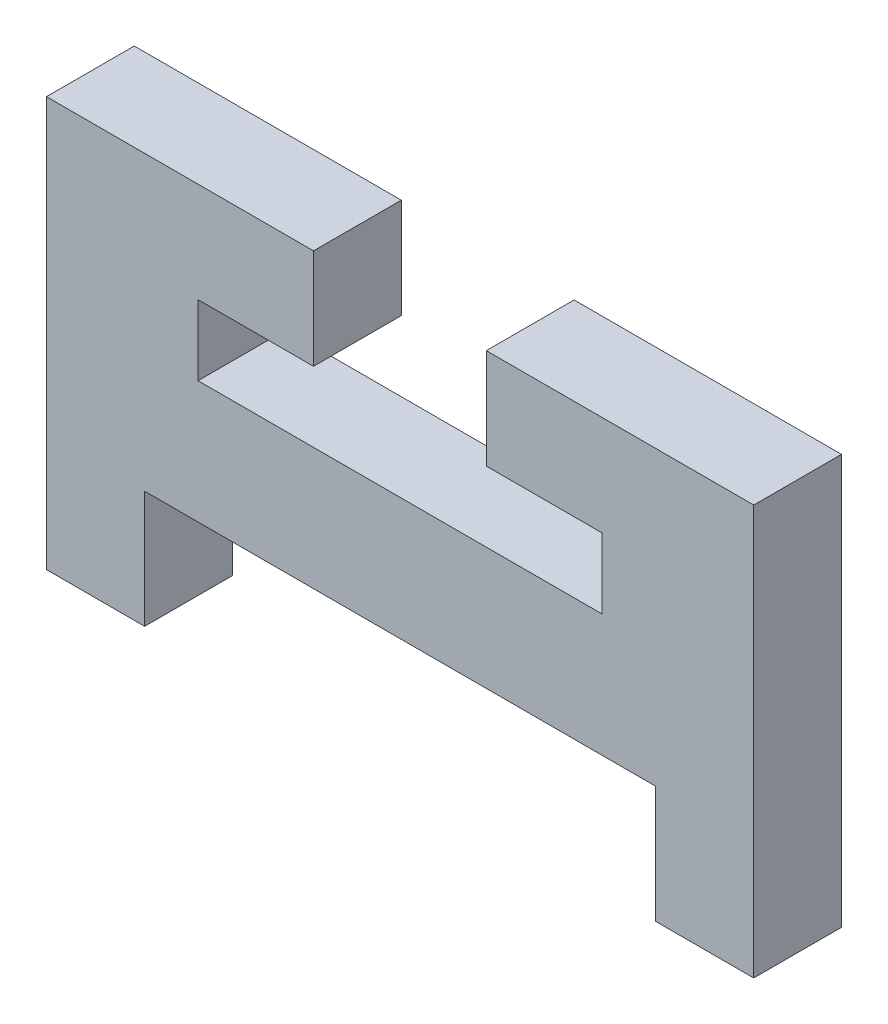
ISO-10303-21;
HEADER;
FILE_DESCRIPTION(('STEP AP214'),'2;1');
FILE_NAME('part.step','',(''),(''),'','','');
FILE_SCHEMA(('AUTOMOTIVE_DESIGN { 1 0 10303 214 1 1 1 1 }'));
ENDSEC;
DATA;
#1=APPLICATION_CONTEXT('core data for automotive mechanical design processes');
#2=APPLICATION_PROTOCOL_DEFINITION('international standard','automotive_design',2000,#1);
#3=PRODUCT_CONTEXT('',#1,'mechanical');
#4=PRODUCT('Part','Part','',(#3));
#5=PRODUCT_RELATED_PRODUCT_CATEGORY('part','',(#4));
#6=PRODUCT_DEFINITION_FORMATION('','',#4);
#7=PRODUCT_DEFINITION_CONTEXT('part definition',#1,'design');
#8=PRODUCT_DEFINITION('design','',#6,#7);
#9=PRODUCT_DEFINITION_SHAPE('','',#8);
#10=(LENGTH_UNIT() NAMED_UNIT(*) SI_UNIT(.MILLI.,.METRE.));
#11=(NAMED_UNIT(*) PLANE_ANGLE_UNIT() SI_UNIT($,.RADIAN.));
#12=(NAMED_UNIT(*) SI_UNIT($,.STERADIAN.) SOLID_ANGLE_UNIT());
#13=UNCERTAINTY_MEASURE_WITH_UNIT(LENGTH_MEASURE(1.E-05),#10,'distance_accuracy_value','');
#14=(GEOMETRIC_REPRESENTATION_CONTEXT(3) GLOBAL_UNCERTAINTY_ASSIGNED_CONTEXT((#13)) GLOBAL_UNIT_ASSIGNED_CONTEXT((#10,
#11,#12)) REPRESENTATION_CONTEXT('',''));
#15=CARTESIAN_POINT('',(0.,0.,0.));
#16=DIRECTION('',(0.,0.,1.));
#17=DIRECTION('',(1.,0.,0.));
#18=AXIS2_PLACEMENT_3D('',#15,#16,#17);
#19=CARTESIAN_POINT('',(31.7,16.7826832944775,3.));
#20=DIRECTION('',(0.,-1.,0.));
#21=DIRECTION('',(0.,0.,-1.));
#22=AXIS2_PLACEMENT_3D('',#19,#20,#21);
#23=PLANE('',#22);
#24=DIRECTION('',(-1.,0.,0.));
#25=VECTOR('',#24,1.);
#26=CARTESIAN_POINT('',(31.7,16.7826832944775,0.));
#27=LINE('',#26,#25);
#28=CARTESIAN_POINT('',(38.1066666666667,16.7826832944775,0.));
#29=VERTEX_POINT('',#28);
#30=CARTESIAN_POINT('',(24.2933333333334,16.7826832944775,0.));
#31=VERTEX_POINT('',#30);
#32=EDGE_CURVE('E110',#29,#31,#27,.T.);
#33=ORIENTED_EDGE('',*,*,#32,.T.);
#34=DIRECTION('',(0.,0.,-1.));
#35=VECTOR('',#34,1.);
#36=CARTESIAN_POINT('',(24.2933333333334,16.7826832944775,3.));
#37=LINE('',#36,#35);
#38=CARTESIAN_POINT('',(24.2933333333334,16.7826832944775,3.));
#39=VERTEX_POINT('',#38);
#40=EDGE_CURVE('E11',#39,#31,#37,.T.);
#41=ORIENTED_EDGE('',*,*,#40,.F.);
#42=DIRECTION('',(-1.,0.,0.));
#43=VECTOR('',#42,1.);
#44=CARTESIAN_POINT('',(38.1066666666667,16.7826832944775,3.));
#45=LINE('',#44,#43);
#46=CARTESIAN_POINT('',(38.1066666666667,16.7826832944775,3.));
#47=VERTEX_POINT('',#46);
#48=EDGE_CURVE('E116',#47,#39,#45,.T.);
#49=ORIENTED_EDGE('',*,*,#48,.F.);
#50=DIRECTION('',(0.,0.,-1.));
#51=VECTOR('',#50,1.);
#52=CARTESIAN_POINT('',(38.1066666666667,16.7826832944775,3.));
#53=LINE('',#52,#51);
#54=EDGE_CURVE('E174',#47,#29,#53,.T.);
#55=ORIENTED_EDGE('',*,*,#54,.T.);
#56=EDGE_LOOP('',(#33,#41,#49,#55));
#57=FACE_BOUND('',#56,.T.);
#58=ADVANCED_FACE('F34',(#57),#23,.F.);
#59=CARTESIAN_POINT('',(24.2933333333334,16.7826832944775,3.));
#60=DIRECTION('',(-1.,0.,0.));
#61=DIRECTION('',(0.,0.,1.));
#62=AXIS2_PLACEMENT_3D('',#59,#60,#61);
#63=PLANE('',#62);
#64=DIRECTION('',(0.,1.,0.));
#65=VECTOR('',#64,1.);
#66=CARTESIAN_POINT('',(24.2933333333334,16.7826832944775,0.));
#67=LINE('',#66,#65);
#68=CARTESIAN_POINT('',(24.2933333333334,19.1826832944775,0.));
#69=VERTEX_POINT('',#68);
#70=EDGE_CURVE('E179',#31,#69,#67,.T.);
#71=ORIENTED_EDGE('',*,*,#70,.T.);
#72=DIRECTION('',(0.,0.,-1.));
#73=VECTOR('',#72,1.);
#74=CARTESIAN_POINT('',(24.2933333333334,19.1826832944775,3.));
#75=LINE('',#74,#73);
#76=CARTESIAN_POINT('',(24.2933333333334,19.1826832944775,3.));
#77=VERTEX_POINT('',#76);
#78=EDGE_CURVE('E42',#77,#69,#75,.T.);
#79=ORIENTED_EDGE('',*,*,#78,.F.);
#80=DIRECTION('',(0.,1.,0.));
#81=VECTOR('',#80,1.);
#82=CARTESIAN_POINT('',(24.2933333333334,16.7826832944775,3.));
#83=LINE('',#82,#81);
#84=EDGE_CURVE('E295',#39,#77,#83,.T.);
#85=ORIENTED_EDGE('',*,*,#84,.F.);
#86=ORIENTED_EDGE('',*,*,#40,.T.);
#87=EDGE_LOOP('',(#71,#79,#85,#86));
#88=FACE_BOUND('',#87,.T.);
#89=ADVANCED_FACE('F298',(#88),#63,.F.);
#90=CARTESIAN_POINT('',(24.2933333333334,19.1826832944775,3.));
#91=DIRECTION('',(0.,1.,0.));
#92=DIRECTION('',(0.,0.,1.));
#93=AXIS2_PLACEMENT_3D('',#90,#91,#92);
#94=PLANE('',#93);
#95=DIRECTION('',(1.,0.,0.));
#96=VECTOR('',#95,1.);
#97=CARTESIAN_POINT('',(24.2933333333334,19.1826832944775,0.));
#98=LINE('',#97,#96);
#99=CARTESIAN_POINT('',(28.24,19.1826832944775,0.));
#100=VERTEX_POINT('',#99);
#101=EDGE_CURVE('E181',#69,#100,#98,.T.);
#102=ORIENTED_EDGE('',*,*,#101,.T.);
#103=DIRECTION('',(0.,0.,-1.));
#104=VECTOR('',#103,1.);
#105=CARTESIAN_POINT('',(28.24,19.1826832944775,3.));
#106=LINE('',#105,#104);
#107=CARTESIAN_POINT('',(28.24,19.1826832944775,3.));
#108=VERTEX_POINT('',#107);
#109=EDGE_CURVE('E238',#108,#100,#106,.T.);
#110=ORIENTED_EDGE('',*,*,#109,.F.);
#111=DIRECTION('',(1.,0.,0.));
#112=VECTOR('',#111,1.);
#113=CARTESIAN_POINT('',(24.2933333333334,19.1826832944775,3.));
#114=LINE('',#113,#112);
#115=EDGE_CURVE('E247',#77,#108,#114,.T.);
#116=ORIENTED_EDGE('',*,*,#115,.F.);
#117=ORIENTED_EDGE('',*,*,#78,.T.);
#118=EDGE_LOOP('',(#102,#110,#116,#117));
#119=FACE_BOUND('',#118,.T.);
#120=ADVANCED_FACE('F245',(#119),#94,.F.);
#121=CARTESIAN_POINT('',(28.24,19.1826832944775,3.));
#122=DIRECTION('',(-1.,0.,0.));
#123=DIRECTION('',(0.,0.,1.));
#124=AXIS2_PLACEMENT_3D('',#121,#122,#123);
#125=PLANE('',#124);
#126=DIRECTION('',(0.,1.,0.));
#127=VECTOR('',#126,1.);
#128=CARTESIAN_POINT('',(28.24,19.1826832944775,0.));
#129=LINE('',#128,#127);
#130=CARTESIAN_POINT('',(28.24,22.6,0.));
#131=VERTEX_POINT('',#130);
#132=EDGE_CURVE('E183',#100,#131,#129,.T.);
#133=ORIENTED_EDGE('',*,*,#132,.T.);
#134=DIRECTION('',(0.,0.,-1.));
#135=VECTOR('',#134,1.);
#136=CARTESIAN_POINT('',(28.24,22.6,3.));
#137=LINE('',#136,#135);
#138=CARTESIAN_POINT('',(28.24,22.6,3.));
#139=VERTEX_POINT('',#138);
#140=EDGE_CURVE('E235',#139,#131,#137,.T.);
#141=ORIENTED_EDGE('',*,*,#140,.F.);
#142=DIRECTION('',(0.,1.,0.));
#143=VECTOR('',#142,1.);
#144=CARTESIAN_POINT('',(28.24,19.1826832944775,3.));
#145=LINE('',#144,#143);
#146=EDGE_CURVE('E265',#108,#139,#145,.T.);
#147=ORIENTED_EDGE('',*,*,#146,.F.);
#148=ORIENTED_EDGE('',*,*,#109,.T.);
#149=EDGE_LOOP('',(#133,#141,#147,#148));
#150=FACE_BOUND('',#149,.T.);
#151=ADVANCED_FACE('F256',(#150),#125,.F.);
#152=CARTESIAN_POINT('',(28.24,22.6,3.));
#153=DIRECTION('',(0.,-1.,0.));
#154=DIRECTION('',(0.,0.,-1.));
#155=AXIS2_PLACEMENT_3D('',#152,#153,#154);
#156=PLANE('',#155);
#157=DIRECTION('',(-1.,0.,0.));
#158=VECTOR('',#157,1.);
#159=CARTESIAN_POINT('',(28.24,22.6,0.));
#160=LINE('',#159,#158);
#161=CARTESIAN_POINT('',(19.1133333333333,22.6,0.));
#162=VERTEX_POINT('',#161);
#163=EDGE_CURVE('E185',#131,#162,#160,.T.);
#164=ORIENTED_EDGE('',*,*,#163,.T.);
#165=DIRECTION('',(0.,0.,-1.));
#166=VECTOR('',#165,1.);
#167=CARTESIAN_POINT('',(19.1133333333333,22.6,3.));
#168=LINE('',#167,#166);
#169=CARTESIAN_POINT('',(19.1133333333333,22.6,3.));
#170=VERTEX_POINT('',#169);
#171=EDGE_CURVE('E232',#170,#162,#168,.T.);
#172=ORIENTED_EDGE('',*,*,#171,.F.);
#173=DIRECTION('',(-1.,0.,0.));
#174=VECTOR('',#173,1.);
#175=CARTESIAN_POINT('',(28.24,22.6,3.));
#176=LINE('',#175,#174);
#177=EDGE_CURVE('E262',#139,#170,#176,.T.);
#178=ORIENTED_EDGE('',*,*,#177,.F.);
#179=ORIENTED_EDGE('',*,*,#140,.T.);
#180=EDGE_LOOP('',(#164,#172,#178,#179));
#181=FACE_BOUND('',#180,.T.);
#182=ADVANCED_FACE('F260',(#181),#156,.F.);
#183=CARTESIAN_POINT('',(19.1133333333333,22.6,3.));
#184=DIRECTION('',(1.,0.,0.));
#185=DIRECTION('',(0.,0.,-1.));
#186=AXIS2_PLACEMENT_3D('',#183,#184,#185);
#187=PLANE('',#186);
#188=DIRECTION('',(0.,-1.,0.));
#189=VECTOR('',#188,1.);
#190=CARTESIAN_POINT('',(19.1133333333333,22.6,0.));
#191=LINE('',#190,#189);
#192=CARTESIAN_POINT('',(19.1133333333333,8.59999999999999,0.));
#193=VERTEX_POINT('',#192);
#194=EDGE_CURVE('E187',#162,#193,#191,.T.);
#195=ORIENTED_EDGE('',*,*,#194,.T.);
#196=DIRECTION('',(0.,0.,-1.));
#197=VECTOR('',#196,1.);
#198=CARTESIAN_POINT('',(19.1133333333333,8.59999999999999,3.));
#199=LINE('',#198,#197);
#200=CARTESIAN_POINT('',(19.1133333333333,8.59999999999999,3.));
#201=VERTEX_POINT('',#200);
#202=EDGE_CURVE('E229',#201,#193,#199,.T.);
#203=ORIENTED_EDGE('',*,*,#202,.F.);
#204=DIRECTION('',(0.,-1.,0.));
#205=VECTOR('',#204,1.);
#206=CARTESIAN_POINT('',(19.1133333333333,22.6,3.));
#207=LINE('',#206,#205);
#208=EDGE_CURVE('E264',#170,#201,#207,.T.);
#209=ORIENTED_EDGE('',*,*,#208,.F.);
#210=ORIENTED_EDGE('',*,*,#171,.T.);
#211=EDGE_LOOP('',(#195,#203,#209,#210));
#212=FACE_BOUND('',#211,.T.);
#213=ADVANCED_FACE('F310',(#212),#187,.F.);
#214=CARTESIAN_POINT('',(19.1133333333333,8.59999999999999,3.));
#215=DIRECTION('',(0.,1.,0.));
#216=DIRECTION('',(0.,0.,1.));
#217=AXIS2_PLACEMENT_3D('',#214,#215,#216);
#218=PLANE('',#217);
#219=DIRECTION('',(1.,0.,0.));
#220=VECTOR('',#219,1.);
#221=CARTESIAN_POINT('',(19.1133333333333,8.59999999999999,0.));
#222=LINE('',#221,#220);
#223=CARTESIAN_POINT('',(22.468,8.59999999999999,0.));
#224=VERTEX_POINT('',#223);
#225=EDGE_CURVE('E189',#193,#224,#222,.T.);
#226=ORIENTED_EDGE('',*,*,#225,.T.);
#227=DIRECTION('',(0.,0.,-1.));
#228=VECTOR('',#227,1.);
#229=CARTESIAN_POINT('',(22.468,8.59999999999999,3.));
#230=LINE('',#229,#228);
#231=CARTESIAN_POINT('',(22.468,8.59999999999999,3.));
#232=VERTEX_POINT('',#231);
#233=EDGE_CURVE('E226',#232,#224,#230,.T.);
#234=ORIENTED_EDGE('',*,*,#233,.F.);
#235=DIRECTION('',(1.,0.,0.));
#236=VECTOR('',#235,1.);
#237=CARTESIAN_POINT('',(19.1133333333333,8.59999999999999,3.));
#238=LINE('',#237,#236);
#239=EDGE_CURVE('E267',#201,#232,#238,.T.);
#240=ORIENTED_EDGE('',*,*,#239,.F.);
#241=ORIENTED_EDGE('',*,*,#202,.T.);
#242=EDGE_LOOP('',(#226,#234,#240,#241));
#243=FACE_BOUND('',#242,.T.);
#244=ADVANCED_FACE('F313',(#243),#218,.F.);
#245=CARTESIAN_POINT('',(22.468,8.59999999999999,3.));
#246=DIRECTION('',(-1.,0.,0.));
#247=DIRECTION('',(0.,0.,1.));
#248=AXIS2_PLACEMENT_3D('',#245,#246,#247);
#249=PLANE('',#248);
#250=DIRECTION('',(0.,1.,0.));
#251=VECTOR('',#250,1.);
#252=CARTESIAN_POINT('',(22.468,8.59999999999999,0.));
#253=LINE('',#252,#251);
#254=CARTESIAN_POINT('',(22.468,12.6,0.));
#255=VERTEX_POINT('',#254);
#256=EDGE_CURVE('E191',#224,#255,#253,.T.);
#257=ORIENTED_EDGE('',*,*,#256,.T.);
#258=DIRECTION('',(0.,0.,-1.));
#259=VECTOR('',#258,1.);
#260=CARTESIAN_POINT('',(22.468,12.6,3.));
#261=LINE('',#260,#259);
#262=CARTESIAN_POINT('',(22.468,12.6,3.));
#263=VERTEX_POINT('',#262);
#264=EDGE_CURVE('E223',#263,#255,#261,.T.);
#265=ORIENTED_EDGE('',*,*,#264,.F.);
#266=DIRECTION('',(0.,1.,0.));
#267=VECTOR('',#266,1.);
#268=CARTESIAN_POINT('',(22.468,8.59999999999999,3.));
#269=LINE('',#268,#267);
#270=EDGE_CURVE('E273',#232,#263,#269,.T.);
#271=ORIENTED_EDGE('',*,*,#270,.F.);
#272=ORIENTED_EDGE('',*,*,#233,.T.);
#273=EDGE_LOOP('',(#257,#265,#271,#272));
#274=FACE_BOUND('',#273,.T.);
#275=ADVANCED_FACE('F317',(#274),#249,.F.);
#276=CARTESIAN_POINT('',(22.468,12.6,3.));
#277=DIRECTION('',(0.,1.,0.));
#278=DIRECTION('',(0.,0.,1.));
#279=AXIS2_PLACEMENT_3D('',#276,#277,#278);
#280=PLANE('',#279);
#281=DIRECTION('',(1.,0.,0.));
#282=VECTOR('',#281,1.);
#283=CARTESIAN_POINT('',(22.468,12.6,0.));
#284=LINE('',#283,#282);
#285=CARTESIAN_POINT('',(39.932,12.6,0.));
#286=VERTEX_POINT('',#285);
#287=EDGE_CURVE('E193',#255,#286,#284,.T.);
#288=ORIENTED_EDGE('',*,*,#287,.T.);
#289=DIRECTION('',(0.,0.,-1.));
#290=VECTOR('',#289,1.);
#291=CARTESIAN_POINT('',(39.932,12.6,3.));
#292=LINE('',#291,#290);
#293=CARTESIAN_POINT('',(39.932,12.6,3.));
#294=VERTEX_POINT('',#293);
#295=EDGE_CURVE('E220',#294,#286,#292,.T.);
#296=ORIENTED_EDGE('',*,*,#295,.F.);
#297=DIRECTION('',(1.,0.,0.));
#298=VECTOR('',#297,1.);
#299=CARTESIAN_POINT('',(22.468,12.6,3.));
#300=LINE('',#299,#298);
#301=EDGE_CURVE('E275',#263,#294,#300,.T.);
#302=ORIENTED_EDGE('',*,*,#301,.F.);
#303=ORIENTED_EDGE('',*,*,#264,.T.);
#304=EDGE_LOOP('',(#288,#296,#302,#303));
#305=FACE_BOUND('',#304,.T.);
#306=ADVANCED_FACE('F321',(#305),#280,.F.);
#307=CARTESIAN_POINT('',(39.932,12.6,3.));
#308=DIRECTION('',(1.,0.,0.));
#309=DIRECTION('',(0.,0.,-1.));
#310=AXIS2_PLACEMENT_3D('',#307,#308,#309);
#311=PLANE('',#310);
#312=DIRECTION('',(0.,-1.,0.));
#313=VECTOR('',#312,1.);
#314=CARTESIAN_POINT('',(39.932,12.6,0.));
#315=LINE('',#314,#313);
#316=CARTESIAN_POINT('',(39.932,8.59999999999999,0.));
#317=VERTEX_POINT('',#316);
#318=EDGE_CURVE('E195',#286,#317,#315,.T.);
#319=ORIENTED_EDGE('',*,*,#318,.T.);
#320=DIRECTION('',(0.,0.,-1.));
#321=VECTOR('',#320,1.);
#322=CARTESIAN_POINT('',(39.932,8.59999999999999,3.));
#323=LINE('',#322,#321);
#324=CARTESIAN_POINT('',(39.932,8.59999999999999,3.));
#325=VERTEX_POINT('',#324);
#326=EDGE_CURVE('E217',#325,#317,#323,.T.);
#327=ORIENTED_EDGE('',*,*,#326,.F.);
#328=DIRECTION('',(0.,-1.,0.));
#329=VECTOR('',#328,1.);
#330=CARTESIAN_POINT('',(39.932,12.6,3.));
#331=LINE('',#330,#329);
#332=EDGE_CURVE('E277',#294,#325,#331,.T.);
#333=ORIENTED_EDGE('',*,*,#332,.F.);
#334=ORIENTED_EDGE('',*,*,#295,.T.);
#335=EDGE_LOOP('',(#319,#327,#333,#334));
#336=FACE_BOUND('',#335,.T.);
#337=ADVANCED_FACE('F325',(#336),#311,.F.);
#338=CARTESIAN_POINT('',(39.932,8.59999999999999,3.));
#339=DIRECTION('',(0.,1.,0.));
#340=DIRECTION('',(0.,0.,1.));
#341=AXIS2_PLACEMENT_3D('',#338,#339,#340);
#342=PLANE('',#341);
#343=DIRECTION('',(1.,0.,0.));
#344=VECTOR('',#343,1.);
#345=CARTESIAN_POINT('',(39.932,8.59999999999999,0.));
#346=LINE('',#345,#344);
#347=CARTESIAN_POINT('',(43.2866666666667,8.59999999999999,0.));
#348=VERTEX_POINT('',#347);
#349=EDGE_CURVE('E197',#317,#348,#346,.T.);
#350=ORIENTED_EDGE('',*,*,#349,.T.);
#351=DIRECTION('',(0.,0.,-1.));
#352=VECTOR('',#351,1.);
#353=CARTESIAN_POINT('',(43.2866666666667,8.59999999999999,3.));
#354=LINE('',#353,#352);
#355=CARTESIAN_POINT('',(43.2866666666667,8.59999999999999,3.));
#356=VERTEX_POINT('',#355);
#357=EDGE_CURVE('E214',#356,#348,#354,.T.);
#358=ORIENTED_EDGE('',*,*,#357,.F.);
#359=DIRECTION('',(1.,0.,0.));
#360=VECTOR('',#359,1.);
#361=CARTESIAN_POINT('',(39.932,8.59999999999999,3.));
#362=LINE('',#361,#360);
#363=EDGE_CURVE('E279',#325,#356,#362,.T.);
#364=ORIENTED_EDGE('',*,*,#363,.F.);
#365=ORIENTED_EDGE('',*,*,#326,.T.);
#366=EDGE_LOOP('',(#350,#358,#364,#365));
#367=FACE_BOUND('',#366,.T.);
#368=ADVANCED_FACE('F329',(#367),#342,.F.);
#369=CARTESIAN_POINT('',(43.2866666666667,8.59999999999999,3.));
#370=DIRECTION('',(-1.,0.,0.));
#371=DIRECTION('',(0.,0.,1.));
#372=AXIS2_PLACEMENT_3D('',#369,#370,#371);
#373=PLANE('',#372);
#374=DIRECTION('',(0.,1.,0.));
#375=VECTOR('',#374,1.);
#376=CARTESIAN_POINT('',(43.2866666666667,8.59999999999999,0.));
#377=LINE('',#376,#375);
#378=CARTESIAN_POINT('',(43.2866666666667,22.6,0.));
#379=VERTEX_POINT('',#378);
#380=EDGE_CURVE('E199',#348,#379,#377,.T.);
#381=ORIENTED_EDGE('',*,*,#380,.T.);
#382=DIRECTION('',(0.,0.,-1.));
#383=VECTOR('',#382,1.);
#384=CARTESIAN_POINT('',(43.2866666666667,22.6,3.));
#385=LINE('',#384,#383);
#386=CARTESIAN_POINT('',(43.2866666666667,22.6,3.));
#387=VERTEX_POINT('',#386);
#388=EDGE_CURVE('E211',#387,#379,#385,.T.);
#389=ORIENTED_EDGE('',*,*,#388,.F.);
#390=DIRECTION('',(0.,1.,0.));
#391=VECTOR('',#390,1.);
#392=CARTESIAN_POINT('',(43.2866666666667,8.59999999999999,3.));
#393=LINE('',#392,#391);
#394=EDGE_CURVE('E281',#356,#387,#393,.T.);
#395=ORIENTED_EDGE('',*,*,#394,.F.);
#396=ORIENTED_EDGE('',*,*,#357,.T.);
#397=EDGE_LOOP('',(#381,#389,#395,#396));
#398=FACE_BOUND('',#397,.T.);
#399=ADVANCED_FACE('F287',(#398),#373,.F.);
#400=CARTESIAN_POINT('',(43.2866666666667,22.6,3.));
#401=DIRECTION('',(0.,-1.,0.));
#402=DIRECTION('',(0.,0.,-1.));
#403=AXIS2_PLACEMENT_3D('',#400,#401,#402);
#404=PLANE('',#403);
#405=DIRECTION('',(-1.,0.,0.));
#406=VECTOR('',#405,1.);
#407=CARTESIAN_POINT('',(43.2866666666667,22.6,0.));
#408=LINE('',#407,#406);
#409=CARTESIAN_POINT('',(34.1465669299953,22.6,0.));
#410=VERTEX_POINT('',#409);
#411=EDGE_CURVE('E201',#379,#410,#408,.T.);
#412=ORIENTED_EDGE('',*,*,#411,.T.);
#413=DIRECTION('',(0.,0.,-1.));
#414=VECTOR('',#413,1.);
#415=CARTESIAN_POINT('',(34.1465669299953,22.6,3.));
#416=LINE('',#415,#414);
#417=CARTESIAN_POINT('',(34.1465669299953,22.6,3.));
#418=VERTEX_POINT('',#417);
#419=EDGE_CURVE('E169',#418,#410,#416,.T.);
#420=ORIENTED_EDGE('',*,*,#419,.F.);
#421=DIRECTION('',(-1.,0.,0.));
#422=VECTOR('',#421,1.);
#423=CARTESIAN_POINT('',(43.2866666666667,22.6,3.));
#424=LINE('',#423,#422);
#425=EDGE_CURVE('E160',#387,#418,#424,.T.);
#426=ORIENTED_EDGE('',*,*,#425,.F.);
#427=ORIENTED_EDGE('',*,*,#388,.T.);
#428=EDGE_LOOP('',(#412,#420,#426,#427));
#429=FACE_BOUND('',#428,.T.);
#430=ADVANCED_FACE('F291',(#429),#404,.F.);
#431=CARTESIAN_POINT('',(34.1465669299953,22.6,3.));
#432=DIRECTION('',(1.,0.,0.));
#433=DIRECTION('',(0.,0.,-1.));
#434=AXIS2_PLACEMENT_3D('',#431,#432,#433);
#435=PLANE('',#434);
#436=DIRECTION('',(0.,-1.,0.));
#437=VECTOR('',#436,1.);
#438=CARTESIAN_POINT('',(34.1465669299953,22.6,0.));
#439=LINE('',#438,#437);
#440=CARTESIAN_POINT('',(34.1465669299953,19.1826832944775,0.));
#441=VERTEX_POINT('',#440);
#442=EDGE_CURVE('E168',#410,#441,#439,.T.);
#443=ORIENTED_EDGE('',*,*,#442,.T.);
#444=DIRECTION('',(0.,0.,-1.));
#445=VECTOR('',#444,1.);
#446=CARTESIAN_POINT('',(34.1465669299953,19.1826832944775,3.));
#447=LINE('',#446,#445);
#448=CARTESIAN_POINT('',(34.1465669299953,19.1826832944775,3.));
#449=VERTEX_POINT('',#448);
#450=EDGE_CURVE('E165',#449,#441,#447,.T.);
#451=ORIENTED_EDGE('',*,*,#450,.F.);
#452=DIRECTION('',(0.,-1.,0.));
#453=VECTOR('',#452,1.);
#454=CARTESIAN_POINT('',(34.1465669299953,22.6,3.));
#455=LINE('',#454,#453);
#456=EDGE_CURVE('E154',#418,#449,#455,.T.);
#457=ORIENTED_EDGE('',*,*,#456,.F.);
#458=ORIENTED_EDGE('',*,*,#419,.T.);
#459=EDGE_LOOP('',(#443,#451,#457,#458));
#460=FACE_BOUND('',#459,.T.);
#461=ADVANCED_FACE('F166',(#460),#435,.F.);
#462=CARTESIAN_POINT('',(34.1465669299953,19.1826832944775,3.));
#463=DIRECTION('',(0.,1.,0.));
#464=DIRECTION('',(0.,0.,1.));
#465=AXIS2_PLACEMENT_3D('',#462,#463,#464);
#466=PLANE('',#465);
#467=DIRECTION('',(1.,0.,0.));
#468=VECTOR('',#467,1.);
#469=CARTESIAN_POINT('',(34.1465669299953,19.1826832944775,0.));
#470=LINE('',#469,#468);
#471=CARTESIAN_POINT('',(38.1066666666667,19.1826832944775,0.));
#472=VERTEX_POINT('',#471);
#473=EDGE_CURVE('E103',#441,#472,#470,.T.);
#474=ORIENTED_EDGE('',*,*,#473,.T.);
#475=DIRECTION('',(0.,0.,-1.));
#476=VECTOR('',#475,1.);
#477=CARTESIAN_POINT('',(38.1066666666667,19.1826832944775,3.));
#478=LINE('',#477,#476);
#479=CARTESIAN_POINT('',(38.1066666666667,19.1826832944775,3.));
#480=VERTEX_POINT('',#479);
#481=EDGE_CURVE('E170',#480,#472,#478,.T.);
#482=ORIENTED_EDGE('',*,*,#481,.F.);
#483=DIRECTION('',(1.,0.,0.));
#484=VECTOR('',#483,1.);
#485=CARTESIAN_POINT('',(34.1465669299953,19.1826832944775,3.));
#486=LINE('',#485,#484);
#487=EDGE_CURVE('E158',#449,#480,#486,.T.);
#488=ORIENTED_EDGE('',*,*,#487,.F.);
#489=ORIENTED_EDGE('',*,*,#450,.T.);
#490=EDGE_LOOP('',(#474,#482,#488,#489));
#491=FACE_BOUND('',#490,.T.);
#492=ADVANCED_FACE('F172',(#491),#466,.F.);
#493=CARTESIAN_POINT('',(38.1066666666667,19.1826832944775,3.));
#494=DIRECTION('',(1.,0.,0.));
#495=DIRECTION('',(0.,0.,-1.));
#496=AXIS2_PLACEMENT_3D('',#493,#494,#495);
#497=PLANE('',#496);
#498=DIRECTION('',(0.,-1.,0.));
#499=VECTOR('',#498,1.);
#500=CARTESIAN_POINT('',(38.1066666666667,19.1826832944775,0.));
#501=LINE('',#500,#499);
#502=EDGE_CURVE('E205',#472,#29,#501,.T.);
#503=ORIENTED_EDGE('',*,*,#502,.T.);
#504=ORIENTED_EDGE('',*,*,#54,.F.);
#505=DIRECTION('',(0.,-1.,0.));
#506=VECTOR('',#505,1.);
#507=CARTESIAN_POINT('',(38.1066666666667,19.1826832944775,3.));
#508=LINE('',#507,#506);
#509=EDGE_CURVE('E50',#480,#47,#508,.T.);
#510=ORIENTED_EDGE('',*,*,#509,.F.);
#511=ORIENTED_EDGE('',*,*,#481,.T.);
#512=EDGE_LOOP('',(#503,#504,#510,#511));
#513=FACE_BOUND('',#512,.T.);
#514=ADVANCED_FACE('F293',(#513),#497,.F.);
#515=CARTESIAN_POINT('',(0.,0.,3.));
#516=DIRECTION('',(0.,0.,-1.));
#517=DIRECTION('',(-1.,0.,0.));
#518=AXIS2_PLACEMENT_3D('',#515,#516,#517);
#519=PLANE('',#518);
#520=ORIENTED_EDGE('',*,*,#48,.T.);
#521=ORIENTED_EDGE('',*,*,#84,.T.);
#522=ORIENTED_EDGE('',*,*,#115,.T.);
#523=ORIENTED_EDGE('',*,*,#146,.T.);
#524=ORIENTED_EDGE('',*,*,#177,.T.);
#525=ORIENTED_EDGE('',*,*,#208,.T.);
#526=ORIENTED_EDGE('',*,*,#239,.T.);
#527=ORIENTED_EDGE('',*,*,#270,.T.);
#528=ORIENTED_EDGE('',*,*,#301,.T.);
#529=ORIENTED_EDGE('',*,*,#332,.T.);
#530=ORIENTED_EDGE('',*,*,#363,.T.);
#531=ORIENTED_EDGE('',*,*,#394,.T.);
#532=ORIENTED_EDGE('',*,*,#425,.T.);
#533=ORIENTED_EDGE('',*,*,#456,.T.);
#534=ORIENTED_EDGE('',*,*,#487,.T.);
#535=ORIENTED_EDGE('',*,*,#509,.T.);
#536=EDGE_LOOP('',(#520,#521,#522,#523,#524,#525,#526,#527,#528,#529,#530,#531,#532,#533,#534,#535));
#537=FACE_BOUND('',#536,.T.);
#538=ADVANCED_FACE('F156',(#537),#519,.F.);
#539=CARTESIAN_POINT('',(0.,0.,0.));
#540=DIRECTION('',(0.,0.,-1.));
#541=DIRECTION('',(-1.,0.,0.));
#542=AXIS2_PLACEMENT_3D('',#539,#540,#541);
#543=PLANE('',#542);
#544=ORIENTED_EDGE('',*,*,#32,.F.);
#545=ORIENTED_EDGE('',*,*,#502,.F.);
#546=ORIENTED_EDGE('',*,*,#473,.F.);
#547=ORIENTED_EDGE('',*,*,#442,.F.);
#548=ORIENTED_EDGE('',*,*,#411,.F.);
#549=ORIENTED_EDGE('',*,*,#380,.F.);
#550=ORIENTED_EDGE('',*,*,#349,.F.);
#551=ORIENTED_EDGE('',*,*,#318,.F.);
#552=ORIENTED_EDGE('',*,*,#287,.F.);
#553=ORIENTED_EDGE('',*,*,#256,.F.);
#554=ORIENTED_EDGE('',*,*,#225,.F.);
#555=ORIENTED_EDGE('',*,*,#194,.F.);
#556=ORIENTED_EDGE('',*,*,#163,.F.);
#557=ORIENTED_EDGE('',*,*,#132,.F.);
#558=ORIENTED_EDGE('',*,*,#101,.F.);
#559=ORIENTED_EDGE('',*,*,#70,.F.);
#560=EDGE_LOOP('',(#544,#545,#546,#547,#548,#549,#550,#551,#552,#553,#554,#555,#556,#557,#558,#559));
#561=FACE_BOUND('',#560,.T.);
#562=ADVANCED_FACE('F251',(#561),#543,.T.);
#563=CLOSED_SHELL('',(#58,#89,#120,#151,#182,#213,#244,#275,#306,#337,#368,#399,#430,#461,#492,
#514,#538,#562));
#564=MANIFOLD_SOLID_BREP('B2',#563);
#565=ADVANCED_BREP_SHAPE_REPRESENTATION('',(#18,#564),#14);
#566=SHAPE_DEFINITION_REPRESENTATION(#9,#565);
ENDSEC;
END-ISO-10303-21;
